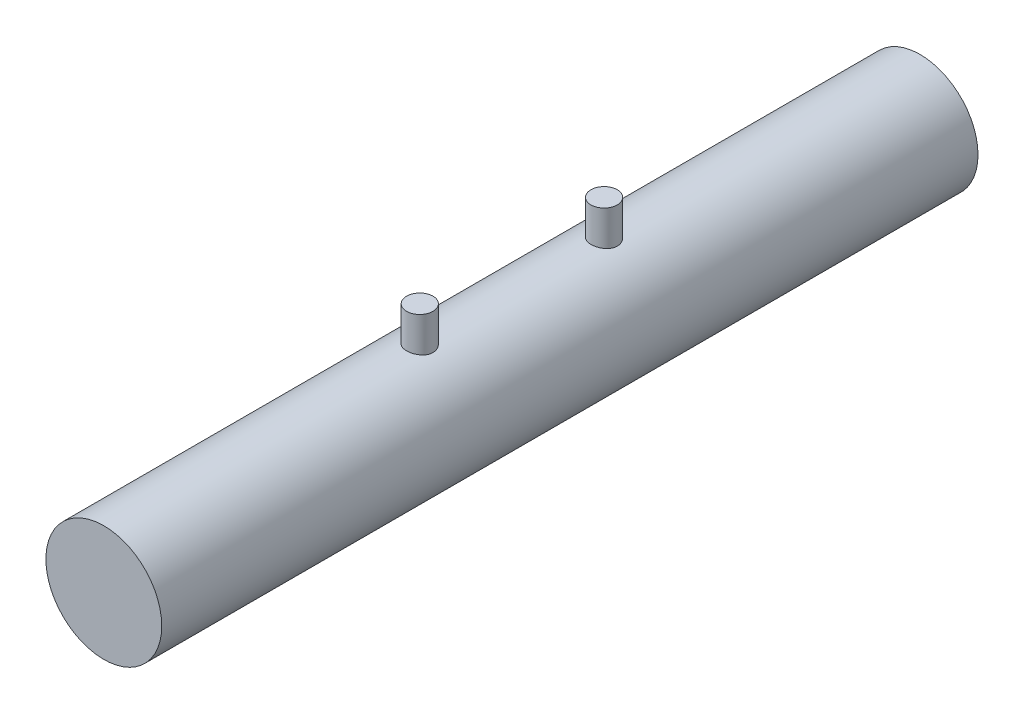
ISO-10303-21;
HEADER;
FILE_DESCRIPTION(('STEP AP214'),'2;1');
FILE_NAME('part.step','',(''),(''),'','','');
FILE_SCHEMA(('AUTOMOTIVE_DESIGN { 1 0 10303 214 1 1 1 1 }'));
ENDSEC;
DATA;
#1=APPLICATION_CONTEXT('core data for automotive mechanical design processes');
#2=APPLICATION_PROTOCOL_DEFINITION('international standard','automotive_design',2000,#1);
#3=PRODUCT_CONTEXT('',#1,'mechanical');
#4=PRODUCT('Part','Part','',(#3));
#5=PRODUCT_RELATED_PRODUCT_CATEGORY('part','',(#4));
#6=PRODUCT_DEFINITION_FORMATION('','',#4);
#7=PRODUCT_DEFINITION_CONTEXT('part definition',#1,'design');
#8=PRODUCT_DEFINITION('design','',#6,#7);
#9=PRODUCT_DEFINITION_SHAPE('','',#8);
#10=(LENGTH_UNIT() NAMED_UNIT(*) SI_UNIT(.MILLI.,.METRE.));
#11=(NAMED_UNIT(*) PLANE_ANGLE_UNIT() SI_UNIT($,.RADIAN.));
#12=(NAMED_UNIT(*) SI_UNIT($,.STERADIAN.) SOLID_ANGLE_UNIT());
#13=UNCERTAINTY_MEASURE_WITH_UNIT(LENGTH_MEASURE(1.E-05),#10,'distance_accuracy_value','');
#14=(GEOMETRIC_REPRESENTATION_CONTEXT(3) GLOBAL_UNCERTAINTY_ASSIGNED_CONTEXT((#13)) GLOBAL_UNIT_ASSIGNED_CONTEXT((#10,
#11,#12)) REPRESENTATION_CONTEXT('',''));
#15=CARTESIAN_POINT('',(0.,0.,0.));
#16=DIRECTION('',(0.,0.,1.));
#17=DIRECTION('',(1.,0.,0.));
#18=AXIS2_PLACEMENT_3D('',#15,#16,#17);
#19=CARTESIAN_POINT('',(0.,0.,1550.));
#20=DIRECTION('',(0.,0.,-1.));
#21=DIRECTION('',(-1.,0.,0.));
#22=AXIS2_PLACEMENT_3D('',#19,#20,#21);
#23=CYLINDRICAL_SURFACE('',#22,110.);
#24=CARTESIAN_POINT('',(1.11022302462516E-13,110.,975.));
#25=CARTESIAN_POINT('',(0.692661326796941,109.999998241697,974.999996610179));
#26=CARTESIAN_POINT('',(1.38539470263615,109.993440996807,974.971188771759));
#27=CARTESIAN_POINT('',(2.76589196285571,109.967389195927,974.856181408265));
#28=CARTESIAN_POINT('',(3.45365513476021,109.947892820903,974.769973813699));
#29=CARTESIAN_POINT('',(4.81962572216827,109.896490378727,974.540804156343));
#30=CARTESIAN_POINT('',(5.49782705253544,109.864576748669,974.397807504271));
#31=CARTESIAN_POINT('',(6.83939275154179,109.789225876059,974.056222333349));
#32=CARTESIAN_POINT('',(7.50275760488373,109.745789010564,973.857635633482));
#33=CARTESIAN_POINT('',(8.8093450505945,109.648639604598,973.406677622025));
#34=CARTESIAN_POINT('',(9.45258888624734,109.594938358584,973.154365393088));
#35=CARTESIAN_POINT('',(10.7153328489279,109.478690663456,972.597737650205));
#36=CARTESIAN_POINT('',(11.3348328067955,109.41614415134,972.293421765851));
#37=CARTESIAN_POINT('',(12.5459545304029,109.283896992301,971.635020002079));
#38=CARTESIAN_POINT('',(13.1375773740824,109.214196622331,971.280936049183));
#39=CARTESIAN_POINT('',(14.2891279509598,109.069508300909,970.525472969217));
#40=CARTESIAN_POINT('',(14.8490553348369,108.994520291201,970.124093321044));
#41=CARTESIAN_POINT('',(15.9420105644142,108.840073687745,969.270200349787));
#42=CARTESIAN_POINT('',(16.4744884121851,108.76056388708,968.816992170081));
#43=CARTESIAN_POINT('',(17.4995380925749,108.600346865195,967.867684781668));
#44=CARTESIAN_POINT('',(17.9921095222769,108.519639631895,967.37158514001));
#45=CARTESIAN_POINT('',(18.9341124830428,108.359253138112,966.339750170489));
#46=CARTESIAN_POINT('',(19.3835400689413,108.279573972213,965.80401122584));
#47=CARTESIAN_POINT('',(20.2361584406563,108.123474735546,964.696472213094));
#48=CARTESIAN_POINT('',(20.6393490267089,108.047054678859,964.124671989214));
#49=CARTESIAN_POINT('',(21.4012485383399,107.898744492299,962.941695092144));
#50=CARTESIAN_POINT('',(21.7593625978984,107.826920081781,962.330126809536));
#51=CARTESIAN_POINT('',(22.4226951609668,107.690934798511,961.078114734678));
#52=CARTESIAN_POINT('',(22.7279131212085,107.62677400447,960.437670645946));
#53=CARTESIAN_POINT('',(23.2830633706995,107.508044289197,959.132460735027));
#54=CARTESIAN_POINT('',(23.5330012420681,107.4534743996,958.467697376479));
#55=CARTESIAN_POINT('',(23.9756125518218,107.355584104454,957.118566299723));
#56=CARTESIAN_POINT('',(24.1682871089064,107.312263479141,956.434198964785));
#57=CARTESIAN_POINT('',(24.4920322349193,107.238833764475,955.062472835884));
#58=CARTESIAN_POINT('',(24.6240797258459,107.208515725302,954.375355739763));
#59=CARTESIAN_POINT('',(24.8301586521634,107.160974423059,952.992025508107));
#60=CARTESIAN_POINT('',(24.904190673317,107.143751027775,952.295812464482));
#61=CARTESIAN_POINT('',(24.9936041347245,107.122928774037,950.899508067213));
#62=CARTESIAN_POINT('',(25.0089924055478,107.11932832884,950.199417174756));
#63=CARTESIAN_POINT('',(24.9810045334157,107.125858795795,948.800479809175));
#64=CARTESIAN_POINT('',(24.9376290464816,107.135989554656,948.101633322246));
#65=CARTESIAN_POINT('',(24.7939265348448,107.169335585975,946.724144993405));
#66=CARTESIAN_POINT('',(24.6947437800439,107.192287899706,946.045377027523));
#67=CARTESIAN_POINT('',(24.4410854295284,107.250409079937,944.698798433953));
#68=CARTESIAN_POINT('',(24.2866106732917,107.28557776096,944.030987640068));
#69=CARTESIAN_POINT('',(23.9235826059243,107.367112098676,942.710910535671));
#70=CARTESIAN_POINT('',(23.7150270639911,107.413478217252,942.058644867597));
#71=CARTESIAN_POINT('',(23.2454350973669,107.516079995668,940.774089957304));
#72=CARTESIAN_POINT('',(22.9843979808469,107.572315785613,940.141800978551));
#73=CARTESIAN_POINT('',(22.4093265804553,107.693589029319,938.89609501626));
#74=CARTESIAN_POINT('',(22.0948600184323,107.758697341168,938.28288453162));
#75=CARTESIAN_POINT('',(21.4167670619897,107.89551270079,937.085056910184));
#76=CARTESIAN_POINT('',(21.0531405086371,107.967219769897,936.500439865837));
#77=CARTESIAN_POINT('',(20.2791944198933,108.115260061647,935.363496277167));
#78=CARTESIAN_POINT('',(19.8688691538927,108.191593851518,934.81117370846));
#79=CARTESIAN_POINT('',(19.0043027899511,108.346801134279,933.742419453477));
#80=CARTESIAN_POINT('',(18.5500609953856,108.425674667443,933.225988336751));
#81=CARTESIAN_POINT('',(17.5894899783483,108.585691346279,932.220674434073));
#82=CARTESIAN_POINT('',(17.082189790174,108.666844373873,931.732720473786));
#83=CARTESIAN_POINT('',(16.0280934413768,108.827314500171,930.801172918683));
#84=CARTESIAN_POINT('',(15.4812966427923,108.906631569194,930.357580040678));
#85=CARTESIAN_POINT('',(14.3518505832666,109.061217727519,929.517822433735));
#86=CARTESIAN_POINT('',(13.769200295697,109.136486700793,929.121659063852));
#87=CARTESIAN_POINT('',(12.5719874696551,109.280870272304,928.379613577431));
#88=CARTESIAN_POINT('',(11.9574251037683,109.349984903819,928.033731189005));
#89=CARTESIAN_POINT('',(10.6990328601993,109.480280175365,927.394025032109));
#90=CARTESIAN_POINT('',(10.0551345117776,109.541440819056,927.100331813863));
#91=CARTESIAN_POINT('',(8.74400131957606,109.653888720593,926.568334382822));
#92=CARTESIAN_POINT('',(8.07676637428639,109.705175935487,926.330030410994));
#93=CARTESIAN_POINT('',(6.72384699823905,109.796400013784,925.910762687967));
#94=CARTESIAN_POINT('',(6.03816494264964,109.836338330838,925.729791592812));
#95=CARTESIAN_POINT('',(4.65332069684255,109.903717496096,925.426660882242));
#96=CARTESIAN_POINT('',(3.95415877844123,109.931158596029,925.304500082226));
#97=CARTESIAN_POINT('',(2.56263840082515,109.972301084559,925.12200313111));
#98=CARTESIAN_POINT('',(1.87045403939353,109.9862836661,925.060401093202));
#99=CARTESIAN_POINT('',(0.483223220123192,110.001125526697,924.995027596609));
#100=CARTESIAN_POINT('',(-0.211823196834588,110.001984992554,924.991255314743));
#101=CARTESIAN_POINT('',(-1.59965943622454,109.990556996208,925.041570153657));
#102=CARTESIAN_POINT('',(-2.29244940945609,109.978270431427,925.095653324898));
#103=CARTESIAN_POINT('',(-3.67078269083513,109.940896225139,925.261221643351));
#104=CARTESIAN_POINT('',(-4.35632602000855,109.915808620784,925.372706623966));
#105=CARTESIAN_POINT('',(-5.70708902137647,109.853906632708,925.650485127318));
#106=CARTESIAN_POINT('',(-6.37245376750325,109.817236292058,925.816106250037));
#107=CARTESIAN_POINT('',(-7.68670089969132,109.733077235489,926.201186760425));
#108=CARTESIAN_POINT('',(-8.33558345841763,109.685588632953,926.420645583842));
#109=CARTESIAN_POINT('',(-9.61253405159839,109.58106427658,926.911752400881));
#110=CARTESIAN_POINT('',(-10.2406007005596,109.524027888772,927.183403860264));
#111=CARTESIAN_POINT('',(-11.4717399698375,109.401928230222,927.776899619741));
#112=CARTESIAN_POINT('',(-12.0748121955544,109.336864832818,928.098744711886));
#113=CARTESIAN_POINT('',(-13.2610243002514,109.199391819088,928.795623443037));
#114=CARTESIAN_POINT('',(-13.8437214359667,109.126885511086,929.171391685311));
#115=CARTESIAN_POINT('',(-14.9755263614756,108.977334889147,929.969693052657));
#116=CARTESIAN_POINT('',(-15.5246338667235,108.900290536778,930.392226573804));
#117=CARTESIAN_POINT('',(-16.5857660754522,108.743735836449,931.281252379254));
#118=CARTESIAN_POINT('',(-17.0977861993623,108.664225185674,931.747750075968));
#119=CARTESIAN_POINT('',(-18.0813500245789,108.504898712133,932.721581839436));
#120=CARTESIAN_POINT('',(-18.5528932542441,108.425082885823,933.228916381891));
#121=CARTESIAN_POINT('',(-19.4614211352674,108.265738303079,934.291673325715));
#122=CARTESIAN_POINT('',(-19.897524220966,108.186247330166,934.847855474078));
#123=CARTESIAN_POINT('',(-20.7213426531829,108.031484722199,935.995538861676));
#124=CARTESIAN_POINT('',(-21.1090572747717,107.956213150366,936.587040629854));
#125=CARTESIAN_POINT('',(-21.8332833934119,107.812077796043,937.801333534627));
#126=CARTESIAN_POINT('',(-22.1697962267063,107.743213846346,938.424123854101));
#127=CARTESIAN_POINT('',(-22.7890975995751,107.613926425169,939.69671103574));
#128=CARTESIAN_POINT('',(-23.0718867904658,107.553502851365,940.346507570379));
#129=CARTESIAN_POINT('',(-23.5800404266858,107.44323593459,941.664670786408));
#130=CARTESIAN_POINT('',(-23.8057305382291,107.393332872904,942.332906880417));
#131=CARTESIAN_POINT('',(-24.2000068235756,107.305174761323,943.686779090582));
#132=CARTESIAN_POINT('',(-24.3685930973645,107.266919691033,944.372415176269));
#133=CARTESIAN_POINT('',(-24.6472326119355,107.203238676105,945.755967426001));
#134=CARTESIAN_POINT('',(-24.7572944400756,107.17781084934,946.453881772908));
#135=CARTESIAN_POINT('',(-24.917976347583,107.140567905725,947.856876434574));
#136=CARTESIAN_POINT('',(-24.9685975635338,107.128752528588,948.561956612052));
#137=CARTESIAN_POINT('',(-25.009473417579,107.119216943124,949.957267127155));
#138=CARTESIAN_POINT('',(-25.0011262500432,107.121170263893,950.647454666695));
#139=CARTESIAN_POINT('',(-24.9274237221039,107.138345038686,952.024604030129));
#140=CARTESIAN_POINT('',(-24.862069311701,107.153566271605,952.711565907586));
#141=CARTESIAN_POINT('',(-24.6748963747366,107.196822182864,954.077324324286));
#142=CARTESIAN_POINT('',(-24.5530789803158,107.224856604287,954.75612102697));
#143=CARTESIAN_POINT('',(-24.2539702468971,107.292909433283,956.100763688844));
#144=CARTESIAN_POINT('',(-24.0766786463819,107.332927897352,956.766609586966));
#145=CARTESIAN_POINT('',(-23.6688583338913,107.423594005068,958.078042858834));
#146=CARTESIAN_POINT('',(-23.4385499202383,107.474197587521,958.723701841276));
#147=CARTESIAN_POINT('',(-22.9260453449753,107.584688083132,959.993250525304));
#148=CARTESIAN_POINT('',(-22.6438494585808,107.644574947049,960.617140342336));
#149=CARTESIAN_POINT('',(-22.0295930674274,107.771960009918,961.839117869579));
#150=CARTESIAN_POINT('',(-21.697528233056,107.839458869614,962.437203333652));
#151=CARTESIAN_POINT('',(-20.9858674584965,107.980205971755,963.603682446965));
#152=CARTESIAN_POINT('',(-20.6062706786666,108.053454315754,964.172075571445));
#153=CARTESIAN_POINT('',(-19.7933384769655,108.205352803741,965.287588384907));
#154=CARTESIAN_POINT('',(-19.3590130689556,108.284085830075,965.833975571857));
#155=CARTESIAN_POINT('',(-18.4463556435907,108.443286913911,966.888403567028));
#156=CARTESIAN_POINT('',(-17.9680229323433,108.523754998756,967.396443770376));
#157=CARTESIAN_POINT('',(-16.9704223028343,108.684221476689,968.370930253596));
#158=CARTESIAN_POINT('',(-16.4511450541028,108.764219758228,968.837367000933));
#159=CARTESIAN_POINT('',(-15.3751747743108,108.921529353152,969.725378832053));
#160=CARTESIAN_POINT('',(-14.8184818985551,108.998840677687,970.146954102027));
#161=CARTESIAN_POINT('',(-13.6631474952749,109.149725334212,970.948019870725));
#162=CARTESIAN_POINT('',(-13.0640207022023,109.223229577522,971.326823933147));
#163=CARTESIAN_POINT('',(-11.8351076116173,109.363214213501,972.032528105499));
#164=CARTESIAN_POINT('',(-11.2053197811403,109.429694254451,972.359425616761));
#165=CARTESIAN_POINT('',(-9.91998276217317,109.553687746748,972.958579554213));
#166=CARTESIAN_POINT('',(-9.26445264914398,109.611207686354,973.230875560311));
#167=CARTESIAN_POINT('',(-7.93192711112672,109.715681962941,973.718932993042));
#168=CARTESIAN_POINT('',(-7.25493538474446,109.762638109271,973.934704102206));
#169=CARTESIAN_POINT('',(-6.0358192743473,109.835582846515,974.266751742414));
#170=CARTESIAN_POINT('',(-5.49692031874207,109.863911836159,974.39447723953));
#171=CARTESIAN_POINT('',(-4.4113525341135,109.912852470358,974.613951923844));
#172=CARTESIAN_POINT('',(-3.86468209127523,109.933462486968,974.705693522169));
#173=CARTESIAN_POINT('',(-2.76623295948807,109.966585183804,974.85266566768));
#174=CARTESIAN_POINT('',(-2.21445447759875,109.979098190805,974.907897688303));
#175=CARTESIAN_POINT('',(-1.10846566426414,109.995805381636,974.981562137626));
#176=CARTESIAN_POINT('',(-0.554255898381411,110.000001406964,975.000002712478));
#177=CARTESIAN_POINT('',(1.11022302462516E-13,110.,975.));
#178=B_SPLINE_CURVE_WITH_KNOTS('',3,(#24,#25,#26,#27,#28,#29,#30,#31,#32,#33,#34,#35,#36,#37,
#38,#39,#40,#41,#42,#43,#44,#45,#46,#47,#48,#49,#50,#51,#52,#53,#54,#55,#56,#57,#58,#59,#60,#61,
#62,#63,#64,#65,#66,#67,#68,#69,#70,#71,#72,#73,#74,#75,#76,#77,#78,#79,#80,#81,#82,#83,#84,#85,
#86,#87,#88,#89,#90,#91,#92,#93,#94,#95,#96,#97,#98,#99,#100,#101,#102,#103,#104,#105,#106,#107,
#108,#109,#110,#111,#112,#113,#114,#115,#116,#117,#118,#119,#120,#121,#122,#123,#124,#125,#126,
#127,#128,#129,#130,#131,#132,#133,#134,#135,#136,#137,#138,#139,#140,#141,#142,#143,#144,#145,
#146,#147,#148,#149,#150,#151,#152,#153,#154,#155,#156,#157,#158,#159,#160,#161,#162,#163,#164,
#165,#166,#167,#168,#169,#170,#171,#172,#173,#174,#175,#176,#177),.UNSPECIFIED.,.T.,.F.,(4,2,2,
2,2,2,2,2,2,2,2,2,2,2,2,2,2,2,2,2,2,2,2,2,2,2,2,2,2,2,2,2,2,2,2,2,2,2,2,2,2,2,2,2,2,2,2,2,2,2,2,
2,2,2,2,2,2,2,2,2,2,2,2,2,2,2,2,2,2,2,2,2,2,2,2,2,4),(0.,2.07748090266499,4.15525392776564,
6.23429443604665,8.31326692325949,10.3899648377762,12.4666775447063,14.5433098842385,
16.6199651062257,18.7287395982987,20.8375353790521,22.946523809283,25.0555213509097,
27.1899446760212,29.3243899213754,31.4586195344169,33.5928074502818,35.6912820632242,
37.7897354883046,39.8879444871705,41.9861300624392,44.0427849913771,46.0994086962128,
48.1561172491305,50.2128529160131,52.2870988838825,54.3613515578888,56.4358590477986,
58.5103994499092,60.6335409502948,62.7567167519884,64.8799533769825,67.0031785203736,
69.1316423132343,71.2601153656637,73.3883156646659,75.5164730941014,77.5991336740969,
79.6817646083367,81.7642533795403,83.8467361068071,85.9042781792345,87.9617986882517,
90.0194558705696,92.0771455258073,94.1661356009928,96.2551433700586,98.3444086527904,
100.43369827657,102.564843163856,104.696019974963,106.827141157965,108.958236502761,
111.076888203983,113.195536195543,115.313873229648,117.432169757673,119.500411017195,
121.568617811043,123.636783137016,125.704958212912,127.764689853241,129.824410568894,
131.884310212597,133.944246249135,136.049027054673,138.153841053381,140.259136092554,
142.364422393616,144.499752687097,146.635189850868,148.769073423768,150.902591230016,
152.565041259001,154.227841704343,155.89057503897,157.552940179813),.UNSPECIFIED.);
#179=CARTESIAN_POINT('',(1.11022302462516E-13,110.,975.));
#180=VERTEX_POINT('',#179);
#181=EDGE_CURVE('E88',#180,#180,#178,.T.);
#182=ORIENTED_EDGE('',*,*,#181,.F.);
#183=EDGE_LOOP('',(#182));
#184=FACE_BOUND('',#183,.T.);
#185=CARTESIAN_POINT('',(0.,110.,625.));
#186=CARTESIAN_POINT('',(0.692661326796903,109.999998241697,624.999996610179));
#187=CARTESIAN_POINT('',(1.38539470263611,109.993440996807,624.971188771759));
#188=CARTESIAN_POINT('',(2.76589196285567,109.967389195927,624.856181408265));
#189=CARTESIAN_POINT('',(3.45365513476017,109.947892820903,624.769973813699));
#190=CARTESIAN_POINT('',(4.81962572216823,109.896490378727,624.540804156343));
#191=CARTESIAN_POINT('',(5.49782705253539,109.864576748669,624.397807504271));
#192=CARTESIAN_POINT('',(6.83939275154175,109.789225876059,624.056222333349));
#193=CARTESIAN_POINT('',(7.5027576048837,109.745789010564,623.857635633482));
#194=CARTESIAN_POINT('',(8.80934505059445,109.648639604598,623.406677622025));
#195=CARTESIAN_POINT('',(9.45258888624728,109.594938358584,623.154365393088));
#196=CARTESIAN_POINT('',(10.7153328489279,109.478690663456,622.597737650205));
#197=CARTESIAN_POINT('',(11.3348328067955,109.41614415134,622.293421765851));
#198=CARTESIAN_POINT('',(12.5459545304029,109.283896992301,621.635020002079));
#199=CARTESIAN_POINT('',(13.1375773740824,109.214196622331,621.280936049182));
#200=CARTESIAN_POINT('',(14.2891279509598,109.069508300909,620.525472969217));
#201=CARTESIAN_POINT('',(14.8490553348369,108.994520291201,620.124093321044));
#202=CARTESIAN_POINT('',(15.9420105644142,108.840073687745,619.270200349787));
#203=CARTESIAN_POINT('',(16.4744884121851,108.76056388708,618.816992170081));
#204=CARTESIAN_POINT('',(17.4995380925748,108.600346865195,617.867684781668));
#205=CARTESIAN_POINT('',(17.9921095222768,108.519639631895,617.37158514001));
#206=CARTESIAN_POINT('',(18.9341124830427,108.359253138112,616.339750170489));
#207=CARTESIAN_POINT('',(19.3835400689413,108.279573972213,615.804011225839));
#208=CARTESIAN_POINT('',(20.2361584406563,108.123474735546,614.696472213094));
#209=CARTESIAN_POINT('',(20.6393490267089,108.047054678859,614.124671989214));
#210=CARTESIAN_POINT('',(21.4012485383399,107.898744492299,612.941695092144));
#211=CARTESIAN_POINT('',(21.7593625978984,107.826920081781,612.330126809535));
#212=CARTESIAN_POINT('',(22.4226951609668,107.690934798511,611.078114734678));
#213=CARTESIAN_POINT('',(22.7279131212085,107.62677400447,610.437670645946));
#214=CARTESIAN_POINT('',(23.2830633706995,107.508044289197,609.132460735027));
#215=CARTESIAN_POINT('',(23.5330012420681,107.4534743996,608.467697376479));
#216=CARTESIAN_POINT('',(23.9756125518218,107.355584104454,607.118566299723));
#217=CARTESIAN_POINT('',(24.1682871089064,107.312263479141,606.434198964785));
#218=CARTESIAN_POINT('',(24.4920322349193,107.238833764475,605.062472835884));
#219=CARTESIAN_POINT('',(24.6240797258459,107.208515725302,604.375355739763));
#220=CARTESIAN_POINT('',(24.8301586521634,107.160974423059,602.992025508107));
#221=CARTESIAN_POINT('',(24.9041906733169,107.143751027775,602.295812464482));
#222=CARTESIAN_POINT('',(24.9936041347244,107.122928774037,600.899508067213));
#223=CARTESIAN_POINT('',(25.0089924055477,107.11932832884,600.199417174756));
#224=CARTESIAN_POINT('',(24.9810045334156,107.125858795795,598.800479809175));
#225=CARTESIAN_POINT('',(24.9376290464815,107.135989554656,598.101633322246));
#226=CARTESIAN_POINT('',(24.7939265348448,107.169335585975,596.724144993405));
#227=CARTESIAN_POINT('',(24.6947437800439,107.192287899706,596.045377027523));
#228=CARTESIAN_POINT('',(24.4410854295284,107.250409079937,594.698798433953));
#229=CARTESIAN_POINT('',(24.2866106732917,107.28557776096,594.030987640068));
#230=CARTESIAN_POINT('',(23.9235826059242,107.367112098676,592.71091053567));
#231=CARTESIAN_POINT('',(23.7150270639911,107.413478217252,592.058644867597));
#232=CARTESIAN_POINT('',(23.2454350973668,107.516079995668,590.774089957304));
#233=CARTESIAN_POINT('',(22.9843979808468,107.572315785613,590.141800978551));
#234=CARTESIAN_POINT('',(22.4093265804552,107.693589029319,588.89609501626));
#235=CARTESIAN_POINT('',(22.0948600184323,107.758697341168,588.28288453162));
#236=CARTESIAN_POINT('',(21.4167670619896,107.89551270079,587.085056910183));
#237=CARTESIAN_POINT('',(21.053140508637,107.967219769897,586.500439865837));
#238=CARTESIAN_POINT('',(20.2791944198932,108.115260061647,585.363496277167));
#239=CARTESIAN_POINT('',(19.8688691538927,108.191593851518,584.81117370846));
#240=CARTESIAN_POINT('',(19.004302789951,108.346801134279,583.742419453477));
#241=CARTESIAN_POINT('',(18.5500609953855,108.425674667443,583.225988336751));
#242=CARTESIAN_POINT('',(17.5894899783482,108.585691346279,582.220674434073));
#243=CARTESIAN_POINT('',(17.082189790174,108.666844373873,581.732720473786));
#244=CARTESIAN_POINT('',(16.0280934413767,108.827314500171,580.801172918683));
#245=CARTESIAN_POINT('',(15.4812966427923,108.906631569194,580.357580040678));
#246=CARTESIAN_POINT('',(14.3518505832666,109.061217727519,579.517822433735));
#247=CARTESIAN_POINT('',(13.769200295697,109.136486700793,579.121659063852));
#248=CARTESIAN_POINT('',(12.5719874696551,109.280870272304,578.379613577431));
#249=CARTESIAN_POINT('',(11.9574251037682,109.349984903819,578.033731189005));
#250=CARTESIAN_POINT('',(10.6990328601992,109.480280175365,577.394025032109));
#251=CARTESIAN_POINT('',(10.0551345117776,109.541440819056,577.100331813863));
#252=CARTESIAN_POINT('',(8.74400131957602,109.653888720593,576.568334382821));
#253=CARTESIAN_POINT('',(8.07676637428635,109.705175935487,576.330030410994));
#254=CARTESIAN_POINT('',(6.72384699823901,109.796400013784,575.910762687967));
#255=CARTESIAN_POINT('',(6.03816494264959,109.836338330838,575.729791592812));
#256=CARTESIAN_POINT('',(4.6533206968425,109.903717496096,575.426660882242));
#257=CARTESIAN_POINT('',(3.95415877844119,109.931158596029,575.304500082226));
#258=CARTESIAN_POINT('',(2.56263840082511,109.972301084559,575.122003131109));
#259=CARTESIAN_POINT('',(1.87045403939348,109.9862836661,575.060401093202));
#260=CARTESIAN_POINT('',(0.483223220123146,110.001125526697,574.995027596609));
#261=CARTESIAN_POINT('',(-0.211823196834634,110.001984992554,574.991255314743));
#262=CARTESIAN_POINT('',(-1.59965943622458,109.990556996208,575.041570153657));
#263=CARTESIAN_POINT('',(-2.29244940945612,109.978270431427,575.095653324898));
#264=CARTESIAN_POINT('',(-3.67078269083517,109.940896225139,575.261221643351));
#265=CARTESIAN_POINT('',(-4.35632602000859,109.915808620784,575.372706623966));
#266=CARTESIAN_POINT('',(-5.70708902137651,109.853906632708,575.650485127318));
#267=CARTESIAN_POINT('',(-6.37245376750328,109.817236292058,575.816106250037));
#268=CARTESIAN_POINT('',(-7.68670089969134,109.733077235489,576.201186760425));
#269=CARTESIAN_POINT('',(-8.33558345841764,109.685588632953,576.420645583842));
#270=CARTESIAN_POINT('',(-9.6125340515984,109.58106427658,576.911752400881));
#271=CARTESIAN_POINT('',(-10.2406007005596,109.524027888772,577.183403860264));
#272=CARTESIAN_POINT('',(-11.4717399698375,109.401928230222,577.776899619741));
#273=CARTESIAN_POINT('',(-12.0748121955545,109.336864832818,578.098744711886));
#274=CARTESIAN_POINT('',(-13.2610243002514,109.199391819088,578.795623443037));
#275=CARTESIAN_POINT('',(-13.8437214359668,109.126885511086,579.171391685311));
#276=CARTESIAN_POINT('',(-14.9755263614757,108.977334889147,579.969693052657));
#277=CARTESIAN_POINT('',(-15.5246338667236,108.900290536778,580.392226573804));
#278=CARTESIAN_POINT('',(-16.5857660754523,108.743735836449,581.281252379253));
#279=CARTESIAN_POINT('',(-17.0977861993624,108.664225185674,581.747750075968));
#280=CARTESIAN_POINT('',(-18.0813500245789,108.504898712133,582.721581839436));
#281=CARTESIAN_POINT('',(-18.5528932542442,108.425082885823,583.228916381891));
#282=CARTESIAN_POINT('',(-19.4614211352675,108.265738303079,584.291673325714));
#283=CARTESIAN_POINT('',(-19.897524220966,108.186247330166,584.847855474078));
#284=CARTESIAN_POINT('',(-20.7213426531829,108.031484722199,585.995538861676));
#285=CARTESIAN_POINT('',(-21.1090572747717,107.956213150366,586.587040629854));
#286=CARTESIAN_POINT('',(-21.8332833934119,107.812077796043,587.801333534627));
#287=CARTESIAN_POINT('',(-22.1697962267063,107.743213846346,588.424123854101));
#288=CARTESIAN_POINT('',(-22.7890975995751,107.613926425169,589.69671103574));
#289=CARTESIAN_POINT('',(-23.0718867904658,107.553502851364,590.346507570379));
#290=CARTESIAN_POINT('',(-23.5800404266859,107.44323593459,591.664670786408));
#291=CARTESIAN_POINT('',(-23.8057305382291,107.393332872904,592.332906880417));
#292=CARTESIAN_POINT('',(-24.2000068235756,107.305174761323,593.686779090582));
#293=CARTESIAN_POINT('',(-24.3685930973646,107.266919691033,594.372415176269));
#294=CARTESIAN_POINT('',(-24.6472326119356,107.203238676105,595.755967426001));
#295=CARTESIAN_POINT('',(-24.7572944400756,107.17781084934,596.453881772908));
#296=CARTESIAN_POINT('',(-24.917976347583,107.140567905725,597.856876434574));
#297=CARTESIAN_POINT('',(-24.9685975635339,107.128752528588,598.561956612052));
#298=CARTESIAN_POINT('',(-25.009473417579,107.119216943124,599.957267127155));
#299=CARTESIAN_POINT('',(-25.0011262500432,107.121170263893,600.647454666695));
#300=CARTESIAN_POINT('',(-24.9274237221039,107.138345038686,602.024604030129));
#301=CARTESIAN_POINT('',(-24.862069311701,107.153566271605,602.711565907586));
#302=CARTESIAN_POINT('',(-24.6748963747366,107.196822182864,604.077324324286));
#303=CARTESIAN_POINT('',(-24.5530789803158,107.224856604287,604.75612102697));
#304=CARTESIAN_POINT('',(-24.2539702468972,107.292909433283,606.100763688844));
#305=CARTESIAN_POINT('',(-24.0766786463819,107.332927897352,606.766609586966));
#306=CARTESIAN_POINT('',(-23.6688583338913,107.423594005068,608.078042858834));
#307=CARTESIAN_POINT('',(-23.4385499202384,107.474197587521,608.723701841276));
#308=CARTESIAN_POINT('',(-22.9260453449754,107.584688083132,609.993250525304));
#309=CARTESIAN_POINT('',(-22.6438494585809,107.644574947049,610.617140342336));
#310=CARTESIAN_POINT('',(-22.0295930674275,107.771960009918,611.839117869579));
#311=CARTESIAN_POINT('',(-21.697528233056,107.839458869614,612.437203333651));
#312=CARTESIAN_POINT('',(-20.9858674584966,107.980205971755,613.603682446965));
#313=CARTESIAN_POINT('',(-20.6062706786666,108.053454315754,614.172075571445));
#314=CARTESIAN_POINT('',(-19.7933384769655,108.205352803741,615.287588384907));
#315=CARTESIAN_POINT('',(-19.3590130689556,108.284085830075,615.833975571857));
#316=CARTESIAN_POINT('',(-18.4463556435907,108.443286913911,616.888403567028));
#317=CARTESIAN_POINT('',(-17.9680229323433,108.523754998756,617.396443770376));
#318=CARTESIAN_POINT('',(-16.9704223028344,108.684221476689,618.370930253596));
#319=CARTESIAN_POINT('',(-16.4511450541028,108.764219758228,618.837367000933));
#320=CARTESIAN_POINT('',(-15.3751747743109,108.921529353152,619.725378832053));
#321=CARTESIAN_POINT('',(-14.8184818985551,108.998840677687,620.146954102027));
#322=CARTESIAN_POINT('',(-13.6631474952749,109.149725334212,620.948019870724));
#323=CARTESIAN_POINT('',(-13.0640207022024,109.223229577522,621.326823933147));
#324=CARTESIAN_POINT('',(-11.8351076116173,109.363214213501,622.032528105499));
#325=CARTESIAN_POINT('',(-11.2053197811402,109.429694254451,622.359425616761));
#326=CARTESIAN_POINT('',(-9.91998276217316,109.553687746748,622.958579554213));
#327=CARTESIAN_POINT('',(-9.26445264914399,109.611207686354,623.230875560311));
#328=CARTESIAN_POINT('',(-7.93192711112675,109.715681962941,623.718932993042));
#329=CARTESIAN_POINT('',(-7.25493538474449,109.762638109271,623.934704102205));
#330=CARTESIAN_POINT('',(-6.03581927434734,109.835582846515,624.266751742414));
#331=CARTESIAN_POINT('',(-5.49692031874211,109.863911836159,624.39447723953));
#332=CARTESIAN_POINT('',(-4.41135253411354,109.912852470358,624.613951923844));
#333=CARTESIAN_POINT('',(-3.86468209127528,109.933462486968,624.705693522169));
#334=CARTESIAN_POINT('',(-2.76623295948812,109.966585183804,624.85266566768));
#335=CARTESIAN_POINT('',(-2.21445447759879,109.979098190805,624.907897688303));
#336=CARTESIAN_POINT('',(-1.10846566426418,109.995805381636,624.981562137626));
#337=CARTESIAN_POINT('',(-0.554255898381451,110.000001406964,625.000002712478));
#338=CARTESIAN_POINT('',(0.,110.,625.));
#339=B_SPLINE_CURVE_WITH_KNOTS('',3,(#185,#186,#187,#188,#189,#190,#191,#192,#193,#194,#195,
#196,#197,#198,#199,#200,#201,#202,#203,#204,#205,#206,#207,#208,#209,#210,#211,#212,#213,#214,
#215,#216,#217,#218,#219,#220,#221,#222,#223,#224,#225,#226,#227,#228,#229,#230,#231,#232,#233,
#234,#235,#236,#237,#238,#239,#240,#241,#242,#243,#244,#245,#246,#247,#248,#249,#250,#251,#252,
#253,#254,#255,#256,#257,#258,#259,#260,#261,#262,#263,#264,#265,#266,#267,#268,#269,#270,#271,
#272,#273,#274,#275,#276,#277,#278,#279,#280,#281,#282,#283,#284,#285,#286,#287,#288,#289,#290,
#291,#292,#293,#294,#295,#296,#297,#298,#299,#300,#301,#302,#303,#304,#305,#306,#307,#308,#309,
#310,#311,#312,#313,#314,#315,#316,#317,#318,#319,#320,#321,#322,#323,#324,#325,#326,#327,#328,
#329,#330,#331,#332,#333,#334,#335,#336,#337,#338),.UNSPECIFIED.,.T.,.F.,(4,2,2,2,2,2,2,2,2,2,2,
2,2,2,2,2,2,2,2,2,2,2,2,2,2,2,2,2,2,2,2,2,2,2,2,2,2,2,2,2,2,2,2,2,2,2,2,2,2,2,2,2,2,2,2,2,2,2,2,
2,2,2,2,2,2,2,2,2,2,2,2,2,2,2,2,2,4),(0.,2.07748090266499,4.15525392776564,6.23429443604664,
8.31326692325949,10.3899648377762,12.4666775447063,14.5433098842385,16.6199651062257,
18.7287395982987,20.8375353790521,22.946523809283,25.0555213509097,27.1899446760213,
29.3243899213754,31.4586195344171,33.5928074502818,35.6912820632243,37.7897354883047,
39.8879444871708,41.9861300624393,44.0427849913771,46.0994086962128,48.1561172491305,
50.2128529160132,52.2870988838825,54.3613515578888,56.4358590477986,58.5103994499092,
60.6335409502947,62.7567167519883,64.8799533769825,67.0031785203736,69.1316423132343,
71.2601153656637,73.3883156646659,75.5164730941014,77.5991336740969,79.6817646083367,
81.7642533795403,83.8467361068071,85.9042781792345,87.9617986882517,90.0194558705696,
92.0771455258073,94.1661356009928,96.2551433700586,98.3444086527905,100.43369827657,
102.564843163856,104.696019974963,106.827141157965,108.958236502761,111.076888203983,
113.195536195543,115.313873229648,117.432169757673,119.500411017195,121.568617811043,
123.636783137016,125.704958212912,127.764689853241,129.824410568894,131.884310212597,
133.944246249135,136.049027054673,138.153841053381,140.259136092554,142.364422393616,
144.499752687097,146.635189850868,148.769073423768,150.902591230016,152.565041259001,
154.227841704343,155.89057503897,157.552940179813),.UNSPECIFIED.);
#340=CARTESIAN_POINT('',(0.,110.,625.));
#341=VERTEX_POINT('',#340);
#342=EDGE_CURVE('E46',#341,#341,#339,.T.);
#343=ORIENTED_EDGE('',*,*,#342,.F.);
#344=EDGE_LOOP('',(#343));
#345=FACE_BOUND('',#344,.T.);
#346=CARTESIAN_POINT('',(0.,0.,1550.));
#347=DIRECTION('',(0.,0.,1.));
#348=DIRECTION('',(1.,0.,0.));
#349=AXIS2_PLACEMENT_3D('',#346,#347,#348);
#350=CIRCLE('',#349,110.);
#351=CARTESIAN_POINT('',(110.,0.,1550.));
#352=VERTEX_POINT('',#351);
#353=EDGE_CURVE('E10',#352,#352,#350,.T.);
#354=ORIENTED_EDGE('',*,*,#353,.F.);
#355=EDGE_LOOP('',(#354));
#356=FACE_BOUND('',#355,.T.);
#357=CARTESIAN_POINT('',(0.,0.,0.));
#358=DIRECTION('',(0.,0.,1.));
#359=DIRECTION('',(1.,0.,0.));
#360=AXIS2_PLACEMENT_3D('',#357,#358,#359);
#361=CIRCLE('',#360,110.);
#362=CARTESIAN_POINT('',(110.,0.,0.));
#363=VERTEX_POINT('',#362);
#364=EDGE_CURVE('E39',#363,#363,#361,.T.);
#365=ORIENTED_EDGE('',*,*,#364,.T.);
#366=EDGE_LOOP('',(#365));
#367=FACE_BOUND('',#366,.T.);
#368=ADVANCED_FACE('F36',(#184,#345,#356,#367),#23,.T.);
#369=CARTESIAN_POINT('',(0.,0.,1550.));
#370=DIRECTION('',(0.,0.,1.));
#371=DIRECTION('',(1.,0.,0.));
#372=AXIS2_PLACEMENT_3D('',#369,#370,#371);
#373=PLANE('',#372);
#374=ORIENTED_EDGE('',*,*,#353,.T.);
#375=EDGE_LOOP('',(#374));
#376=FACE_BOUND('',#375,.T.);
#377=ADVANCED_FACE('F76',(#376),#373,.T.);
#378=CARTESIAN_POINT('',(0.,0.,0.));
#379=DIRECTION('',(0.,0.,1.));
#380=DIRECTION('',(1.,0.,0.));
#381=AXIS2_PLACEMENT_3D('',#378,#379,#380);
#382=PLANE('',#381);
#383=ORIENTED_EDGE('',*,*,#364,.F.);
#384=EDGE_LOOP('',(#383));
#385=FACE_BOUND('',#384,.T.);
#386=ADVANCED_FACE('F68',(#385),#382,.F.);
#387=CARTESIAN_POINT('',(0.,175.,600.));
#388=DIRECTION('',(0.,1.,0.));
#389=DIRECTION('',(0.,0.,1.));
#390=AXIS2_PLACEMENT_3D('',#387,#388,#389);
#391=PLANE('',#390);
#392=CARTESIAN_POINT('',(0.,175.,600.));
#393=DIRECTION('',(0.,1.,0.));
#394=DIRECTION('',(0.,0.,1.));
#395=AXIS2_PLACEMENT_3D('',#392,#393,#394);
#396=CIRCLE('',#395,25.);
#397=CARTESIAN_POINT('',(0.,175.,625.));
#398=VERTEX_POINT('',#397);
#399=EDGE_CURVE('E55',#398,#398,#396,.T.);
#400=ORIENTED_EDGE('',*,*,#399,.T.);
#401=EDGE_LOOP('',(#400));
#402=FACE_BOUND('',#401,.T.);
#403=ADVANCED_FACE('F66',(#402),#391,.T.);
#404=CARTESIAN_POINT('',(0.,-110.001,600.));
#405=DIRECTION('',(0.,1.,0.));
#406=DIRECTION('',(0.,0.,1.));
#407=AXIS2_PLACEMENT_3D('',#404,#405,#406);
#408=CYLINDRICAL_SURFACE('',#407,25.);
#409=ORIENTED_EDGE('',*,*,#399,.F.);
#410=EDGE_LOOP('',(#409));
#411=FACE_BOUND('',#410,.T.);
#412=ORIENTED_EDGE('',*,*,#342,.T.);
#413=EDGE_LOOP('',(#412));
#414=FACE_BOUND('',#413,.T.);
#415=ADVANCED_FACE('F57',(#411,#414),#408,.T.);
#416=CARTESIAN_POINT('',(1.11022302462516E-13,175.,950.));
#417=DIRECTION('',(0.,1.,0.));
#418=DIRECTION('',(0.,0.,1.));
#419=AXIS2_PLACEMENT_3D('',#416,#417,#418);
#420=PLANE('',#419);
#421=CARTESIAN_POINT('',(1.11022302462516E-13,175.,950.));
#422=DIRECTION('',(0.,1.,0.));
#423=DIRECTION('',(0.,0.,1.));
#424=AXIS2_PLACEMENT_3D('',#421,#422,#423);
#425=CIRCLE('',#424,25.);
#426=CARTESIAN_POINT('',(1.11022302462516E-13,175.,975.));
#427=VERTEX_POINT('',#426);
#428=EDGE_CURVE('E95',#427,#427,#425,.T.);
#429=ORIENTED_EDGE('',*,*,#428,.T.);
#430=EDGE_LOOP('',(#429));
#431=FACE_BOUND('',#430,.T.);
#432=ADVANCED_FACE('F74',(#431),#420,.T.);
#433=CARTESIAN_POINT('',(1.11022302462516E-13,-110.001,950.));
#434=DIRECTION('',(0.,1.,0.));
#435=DIRECTION('',(0.,0.,1.));
#436=AXIS2_PLACEMENT_3D('',#433,#434,#435);
#437=CYLINDRICAL_SURFACE('',#436,25.);
#438=ORIENTED_EDGE('',*,*,#428,.F.);
#439=EDGE_LOOP('',(#438));
#440=FACE_BOUND('',#439,.T.);
#441=ORIENTED_EDGE('',*,*,#181,.T.);
#442=EDGE_LOOP('',(#441));
#443=FACE_BOUND('',#442,.T.);
#444=ADVANCED_FACE('F63',(#440,#443),#437,.T.);
#445=CLOSED_SHELL('',(#368,#377,#386,#403,#415,#432,#444));
#446=MANIFOLD_SOLID_BREP('B2',#445);
#447=ADVANCED_BREP_SHAPE_REPRESENTATION('',(#18,#446),#14);
#448=SHAPE_DEFINITION_REPRESENTATION(#9,#447);
ENDSEC;
END-ISO-10303-21;
